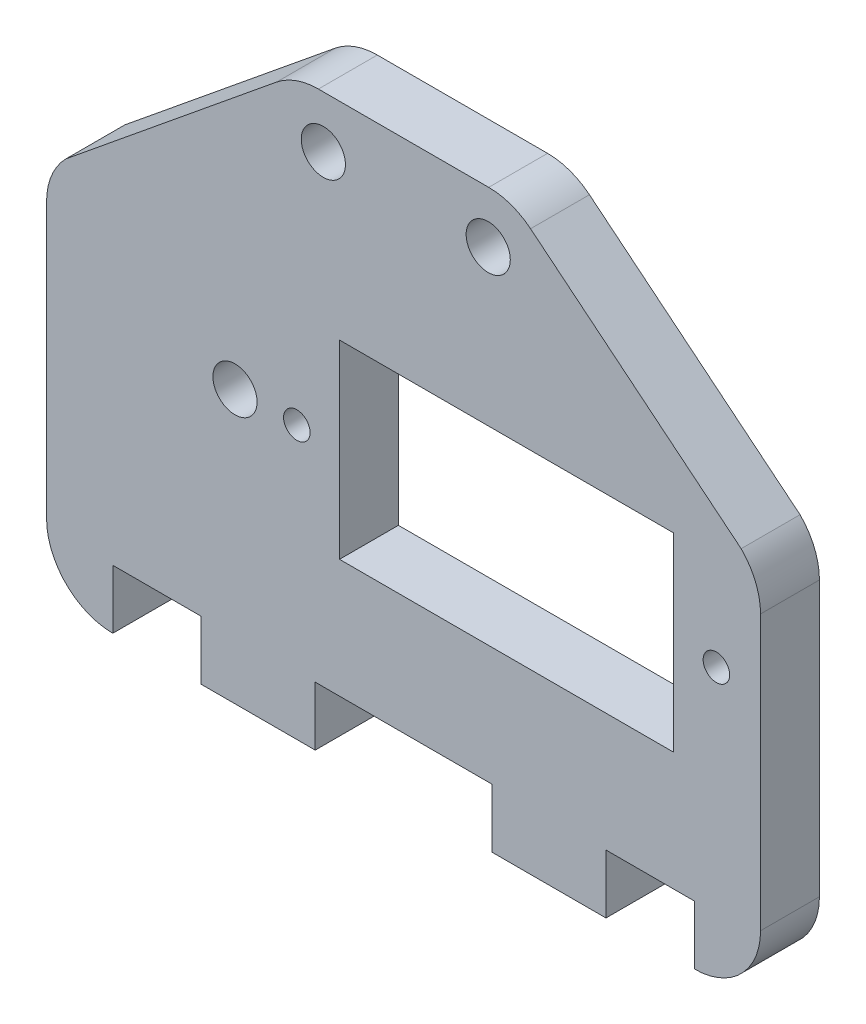
ISO-10303-21;
HEADER;
FILE_DESCRIPTION(('STEP AP214'),'2;1');
FILE_NAME('part.step','',(''),(''),'','','');
FILE_SCHEMA(('AUTOMOTIVE_DESIGN { 1 0 10303 214 1 1 1 1 }'));
ENDSEC;
DATA;
#1=APPLICATION_CONTEXT('core data for automotive mechanical design processes');
#2=APPLICATION_PROTOCOL_DEFINITION('international standard','automotive_design',2000,#1);
#3=PRODUCT_CONTEXT('',#1,'mechanical');
#4=PRODUCT('Part','Part','',(#3));
#5=PRODUCT_RELATED_PRODUCT_CATEGORY('part','',(#4));
#6=PRODUCT_DEFINITION_FORMATION('','',#4);
#7=PRODUCT_DEFINITION_CONTEXT('part definition',#1,'design');
#8=PRODUCT_DEFINITION('design','',#6,#7);
#9=PRODUCT_DEFINITION_SHAPE('','',#8);
#10=(LENGTH_UNIT() NAMED_UNIT(*) SI_UNIT(.MILLI.,.METRE.));
#11=(NAMED_UNIT(*) PLANE_ANGLE_UNIT() SI_UNIT($,.RADIAN.));
#12=(NAMED_UNIT(*) SI_UNIT($,.STERADIAN.) SOLID_ANGLE_UNIT());
#13=UNCERTAINTY_MEASURE_WITH_UNIT(LENGTH_MEASURE(1.E-05),#10,'distance_accuracy_value','');
#14=(GEOMETRIC_REPRESENTATION_CONTEXT(3) GLOBAL_UNCERTAINTY_ASSIGNED_CONTEXT((#13)) GLOBAL_UNIT_ASSIGNED_CONTEXT((#10,
#11,#12)) REPRESENTATION_CONTEXT('',''));
#15=CARTESIAN_POINT('',(0.,0.,0.));
#16=DIRECTION('',(0.,0.,1.));
#17=DIRECTION('',(1.,0.,0.));
#18=AXIS2_PLACEMENT_3D('',#15,#16,#17);
#19=CARTESIAN_POINT('',(44.0000008495149,4.66042127058839,4.));
#20=DIRECTION('',(0.,0.,1.));
#21=DIRECTION('',(1.,0.,0.));
#22=AXIS2_PLACEMENT_3D('',#19,#20,#21);
#23=PLANE('',#22);
#24=CARTESIAN_POINT('',(17.000000849515,18.6604212705884,4.));
#25=DIRECTION('',(0.,0.,1.));
#26=DIRECTION('',(1.,0.,0.));
#27=AXIS2_PLACEMENT_3D('',#24,#25,#26);
#28=CIRCLE('',#27,0.899999999999998);
#29=CARTESIAN_POINT('',(17.900000849515,18.6604212705884,4.));
#30=VERTEX_POINT('',#29);
#31=EDGE_CURVE('E234',#30,#30,#28,.T.);
#32=ORIENTED_EDGE('',*,*,#31,.F.);
#33=EDGE_LOOP('',(#32));
#34=FACE_BOUND('',#33,.T.);
#35=CARTESIAN_POINT('',(30.000000849515,35.6304212705884,4.));
#36=DIRECTION('',(0.,0.,1.));
#37=DIRECTION('',(1.,0.,0.));
#38=AXIS2_PLACEMENT_3D('',#35,#36,#37);
#39=CIRCLE('',#38,1.5);
#40=CARTESIAN_POINT('',(31.500000849515,35.6304212705884,4.));
#41=VERTEX_POINT('',#40);
#42=EDGE_CURVE('E244',#41,#41,#39,.T.);
#43=ORIENTED_EDGE('',*,*,#42,.F.);
#44=EDGE_LOOP('',(#43));
#45=FACE_BOUND('',#44,.T.);
#46=CARTESIAN_POINT('',(12.800000849515,18.6604212705884,4.));
#47=DIRECTION('',(0.,0.,1.));
#48=DIRECTION('',(1.,0.,0.));
#49=AXIS2_PLACEMENT_3D('',#46,#47,#48);
#50=CIRCLE('',#49,1.5);
#51=CARTESIAN_POINT('',(14.300000849515,18.6604212705884,4.));
#52=VERTEX_POINT('',#51);
#53=EDGE_CURVE('E256',#52,#52,#50,.T.);
#54=ORIENTED_EDGE('',*,*,#53,.F.);
#55=EDGE_LOOP('',(#54));
#56=FACE_BOUND('',#55,.T.);
#57=CARTESIAN_POINT('',(44.0000008495149,4.66042127058839,4.));
#58=DIRECTION('',(0.,0.,1.));
#59=DIRECTION('',(1.,0.,0.));
#60=AXIS2_PLACEMENT_3D('',#57,#58,#59);
#61=CIRCLE('',#60,4.5);
#62=CARTESIAN_POINT('',(44.0000008495149,0.160421270588386,4.));
#63=VERTEX_POINT('',#62);
#64=CARTESIAN_POINT('',(48.5000008495149,4.66042127058824,4.));
#65=VERTEX_POINT('',#64);
#66=EDGE_CURVE('E262',#63,#65,#61,.T.);
#67=ORIENTED_EDGE('',*,*,#66,.T.);
#68=DIRECTION('',(0.,1.,0.));
#69=VECTOR('',#68,1.);
#70=CARTESIAN_POINT('',(48.5000008495149,4.66042127058824,4.));
#71=LINE('',#70,#69);
#72=CARTESIAN_POINT('',(48.5000008495154,23.2964602399095,4.));
#73=VERTEX_POINT('',#72);
#74=EDGE_CURVE('E265',#65,#73,#71,.T.);
#75=ORIENTED_EDGE('',*,*,#74,.T.);
#76=CARTESIAN_POINT('',(44.0000008495154,23.2964602399096,4.));
#77=DIRECTION('',(0.,0.,1.));
#78=DIRECTION('',(1.,0.,0.));
#79=AXIS2_PLACEMENT_3D('',#76,#77,#78);
#80=CIRCLE('',#79,4.5);
#81=CARTESIAN_POINT('',(47.1819813648548,26.478440755249,4.));
#82=VERTEX_POINT('',#81);
#83=EDGE_CURVE('E268',#73,#82,#80,.T.);
#84=ORIENTED_EDGE('',*,*,#83,.T.);
#85=DIRECTION('',(-0.774870757012182,0.632119695886284,0.));
#86=VECTOR('',#85,1.);
#87=CARTESIAN_POINT('',(47.1819813648548,26.478440755249,4.));
#88=LINE('',#87,#86);
#89=CARTESIAN_POINT('',(32.8779047794396,38.1473396771433,4.));
#90=VERTEX_POINT('',#89);
#91=EDGE_CURVE('E270',#82,#90,#88,.T.);
#92=ORIENTED_EDGE('',*,*,#91,.T.);
#93=CARTESIAN_POINT('',(30.0333661479511,34.6604212705884,4.));
#94=DIRECTION('',(0.,0.,1.));
#95=DIRECTION('',(1.,0.,0.));
#96=AXIS2_PLACEMENT_3D('',#93,#94,#95);
#97=CIRCLE('',#96,4.50000000000003);
#98=CARTESIAN_POINT('',(30.0333661479511,39.1604212705885,4.));
#99=VERTEX_POINT('',#98);
#100=EDGE_CURVE('E272',#90,#99,#97,.T.);
#101=ORIENTED_EDGE('',*,*,#100,.T.);
#102=DIRECTION('',(-1.,0.,0.));
#103=VECTOR('',#102,1.);
#104=CARTESIAN_POINT('',(30.0333661479511,39.1604212705884,4.));
#105=LINE('',#104,#103);
#106=CARTESIAN_POINT('',(18.4666355510798,39.1604212705884,4.));
#107=VERTEX_POINT('',#106);
#108=EDGE_CURVE('E274',#99,#107,#105,.T.);
#109=ORIENTED_EDGE('',*,*,#108,.T.);
#110=CARTESIAN_POINT('',(18.4666355510798,34.6604212705884,4.));
#111=DIRECTION('',(0.,0.,1.));
#112=DIRECTION('',(1.,0.,0.));
#113=AXIS2_PLACEMENT_3D('',#110,#111,#112);
#114=CIRCLE('',#113,4.49999999999999);
#115=CARTESIAN_POINT('',(15.6220969195915,38.1473396771433,4.));
#116=VERTEX_POINT('',#115);
#117=EDGE_CURVE('E276',#107,#116,#114,.T.);
#118=ORIENTED_EDGE('',*,*,#117,.T.);
#119=DIRECTION('',(-0.77487075701219,-0.632119695886274,0.));
#120=VECTOR('',#119,1.);
#121=CARTESIAN_POINT('',(15.6220969195915,38.1473396771433,4.));
#122=LINE('',#121,#120);
#123=CARTESIAN_POINT('',(1.31802033417569,26.4784407552489,4.));
#124=VERTEX_POINT('',#123);
#125=EDGE_CURVE('E278',#116,#124,#122,.T.);
#126=ORIENTED_EDGE('',*,*,#125,.T.);
#127=CARTESIAN_POINT('',(4.50000084951512,23.2964602399094,4.));
#128=DIRECTION('',(0.,0.,1.));
#129=DIRECTION('',(1.,0.,0.));
#130=AXIS2_PLACEMENT_3D('',#127,#128,#129);
#131=CIRCLE('',#130,4.49999999999987);
#132=CARTESIAN_POINT('',(8.49515243740717E-07,23.2964602399094,4.));
#133=VERTEX_POINT('',#132);
#134=EDGE_CURVE('E280',#124,#133,#131,.T.);
#135=ORIENTED_EDGE('',*,*,#134,.T.);
#136=DIRECTION('',(0.,-1.,0.));
#137=VECTOR('',#136,1.);
#138=CARTESIAN_POINT('',(8.495153452E-07,23.2964602399094,4.));
#139=LINE('',#138,#137);
#140=CARTESIAN_POINT('',(8.495150041E-07,4.66042127058839,4.));
#141=VERTEX_POINT('',#140);
#142=EDGE_CURVE('E282',#133,#141,#139,.T.);
#143=ORIENTED_EDGE('',*,*,#142,.T.);
#144=CARTESIAN_POINT('',(4.50000084951512,4.66042127058839,4.));
#145=DIRECTION('',(0.,0.,1.));
#146=DIRECTION('',(1.,0.,0.));
#147=AXIS2_PLACEMENT_3D('',#144,#145,#146);
#148=CIRCLE('',#147,4.50000000000006);
#149=CARTESIAN_POINT('',(4.50000084951512,0.16042127058833,4.));
#150=VERTEX_POINT('',#149);
#151=EDGE_CURVE('E284',#141,#150,#148,.T.);
#152=ORIENTED_EDGE('',*,*,#151,.T.);
#153=DIRECTION('',(0.,1.,0.));
#154=VECTOR('',#153,1.);
#155=CARTESIAN_POINT('',(4.50000084951512,0.160421270588386,4.));
#156=LINE('',#155,#154);
#157=CARTESIAN_POINT('',(4.50000084951512,4.16042127058839,4.));
#158=VERTEX_POINT('',#157);
#159=EDGE_CURVE('E286',#150,#158,#156,.T.);
#160=ORIENTED_EDGE('',*,*,#159,.T.);
#161=DIRECTION('',(1.,0.,0.));
#162=VECTOR('',#161,1.);
#163=CARTESIAN_POINT('',(4.50000084951512,4.16042127058839,4.));
#164=LINE('',#163,#162);
#165=CARTESIAN_POINT('',(10.500000849515,4.16042127058839,4.));
#166=VERTEX_POINT('',#165);
#167=EDGE_CURVE('E288',#158,#166,#164,.T.);
#168=ORIENTED_EDGE('',*,*,#167,.T.);
#169=DIRECTION('',(0.,-1.,0.));
#170=VECTOR('',#169,1.);
#171=CARTESIAN_POINT('',(10.500000849515,4.16042127058839,4.));
#172=LINE('',#171,#170);
#173=CARTESIAN_POINT('',(10.500000849515,0.160421270588393,4.));
#174=VERTEX_POINT('',#173);
#175=EDGE_CURVE('E290',#166,#174,#172,.T.);
#176=ORIENTED_EDGE('',*,*,#175,.T.);
#177=DIRECTION('',(1.,0.,0.));
#178=VECTOR('',#177,1.);
#179=CARTESIAN_POINT('',(10.500000849515,0.160421270588393,4.));
#180=LINE('',#179,#178);
#181=CARTESIAN_POINT('',(18.250000849515,0.160421270588393,4.));
#182=VERTEX_POINT('',#181);
#183=EDGE_CURVE('E292',#174,#182,#180,.T.);
#184=ORIENTED_EDGE('',*,*,#183,.T.);
#185=DIRECTION('',(0.,1.,0.));
#186=VECTOR('',#185,1.);
#187=CARTESIAN_POINT('',(18.250000849515,4.16042127058839,4.));
#188=LINE('',#187,#186);
#189=CARTESIAN_POINT('',(18.250000849515,4.16042127058839,4.));
#190=VERTEX_POINT('',#189);
#191=EDGE_CURVE('E294',#182,#190,#188,.T.);
#192=ORIENTED_EDGE('',*,*,#191,.T.);
#193=DIRECTION('',(1.,0.,0.));
#194=VECTOR('',#193,1.);
#195=CARTESIAN_POINT('',(18.250000849515,4.16042127058839,4.));
#196=LINE('',#195,#194);
#197=CARTESIAN_POINT('',(30.250000849515,4.16042127058839,4.));
#198=VERTEX_POINT('',#197);
#199=EDGE_CURVE('E296',#190,#198,#196,.T.);
#200=ORIENTED_EDGE('',*,*,#199,.T.);
#201=DIRECTION('',(0.,-1.,0.));
#202=VECTOR('',#201,1.);
#203=CARTESIAN_POINT('',(30.250000849515,4.16042127058839,4.));
#204=LINE('',#203,#202);
#205=CARTESIAN_POINT('',(30.250000849515,0.160421270588393,4.));
#206=VERTEX_POINT('',#205);
#207=EDGE_CURVE('E298',#198,#206,#204,.T.);
#208=ORIENTED_EDGE('',*,*,#207,.T.);
#209=DIRECTION('',(1.,0.,0.));
#210=VECTOR('',#209,1.);
#211=CARTESIAN_POINT('',(30.250000849515,0.160421270588393,4.));
#212=LINE('',#211,#210);
#213=CARTESIAN_POINT('',(38.0000008495148,0.160421270588393,4.));
#214=VERTEX_POINT('',#213);
#215=EDGE_CURVE('E300',#206,#214,#212,.T.);
#216=ORIENTED_EDGE('',*,*,#215,.T.);
#217=DIRECTION('',(0.,1.,0.));
#218=VECTOR('',#217,1.);
#219=CARTESIAN_POINT('',(38.0000008495148,4.16042127058839,4.));
#220=LINE('',#219,#218);
#221=CARTESIAN_POINT('',(38.0000008495148,4.16042127058839,4.));
#222=VERTEX_POINT('',#221);
#223=EDGE_CURVE('E302',#214,#222,#220,.T.);
#224=ORIENTED_EDGE('',*,*,#223,.T.);
#225=DIRECTION('',(1.,0.,0.));
#226=VECTOR('',#225,1.);
#227=CARTESIAN_POINT('',(44.0000008495149,4.16042127058839,4.));
#228=LINE('',#227,#226);
#229=CARTESIAN_POINT('',(44.0000008495149,4.16042127058839,4.));
#230=VERTEX_POINT('',#229);
#231=EDGE_CURVE('E304',#222,#230,#228,.T.);
#232=ORIENTED_EDGE('',*,*,#231,.T.);
#233=DIRECTION('',(0.,-1.,0.));
#234=VECTOR('',#233,1.);
#235=CARTESIAN_POINT('',(44.0000008495149,0.160421270588386,4.));
#236=LINE('',#235,#234);
#237=EDGE_CURVE('E306',#230,#63,#236,.T.);
#238=ORIENTED_EDGE('',*,*,#237,.T.);
#239=EDGE_LOOP('',(#67,#75,#84,#92,#101,#109,#118,#126,#135,#143,#152,#160,#168,#176,#184,#192,
#200,#208,#216,#224,#232,#238));
#240=FACE_BOUND('',#239,.T.);
#241=CARTESIAN_POINT('',(18.800000849515,35.6304212705884,4.));
#242=DIRECTION('',(0.,0.,1.));
#243=DIRECTION('',(1.,0.,0.));
#244=AXIS2_PLACEMENT_3D('',#241,#242,#243);
#245=CIRCLE('',#244,1.5);
#246=CARTESIAN_POINT('',(20.300000849515,35.6304212705884,4.));
#247=VERTEX_POINT('',#246);
#248=EDGE_CURVE('E250',#247,#247,#245,.T.);
#249=ORIENTED_EDGE('',*,*,#248,.F.);
#250=EDGE_LOOP('',(#249));
#251=FACE_BOUND('',#250,.T.);
#252=DIRECTION('',(-1.,0.,0.));
#253=VECTOR('',#252,1.);
#254=CARTESIAN_POINT('',(42.600000849515,25.1104212705884,4.));
#255=LINE('',#254,#253);
#256=CARTESIAN_POINT('',(42.600000849515,25.1104212705884,4.));
#257=VERTEX_POINT('',#256);
#258=CARTESIAN_POINT('',(19.9000008495151,25.1104212705884,4.));
#259=VERTEX_POINT('',#258);
#260=EDGE_CURVE('E213',#257,#259,#255,.T.);
#261=ORIENTED_EDGE('',*,*,#260,.F.);
#262=DIRECTION('',(0.,1.,0.));
#263=VECTOR('',#262,1.);
#264=CARTESIAN_POINT('',(42.600000849515,25.1104212705884,4.));
#265=LINE('',#264,#263);
#266=CARTESIAN_POINT('',(42.600000849515,12.2104212705884,4.));
#267=VERTEX_POINT('',#266);
#268=EDGE_CURVE('E205',#267,#257,#265,.T.);
#269=ORIENTED_EDGE('',*,*,#268,.F.);
#270=DIRECTION('',(1.,0.,0.));
#271=VECTOR('',#270,1.);
#272=CARTESIAN_POINT('',(19.9000008495151,12.2104212705884,4.));
#273=LINE('',#272,#271);
#274=CARTESIAN_POINT('',(19.9000008495151,12.2104212705884,4.));
#275=VERTEX_POINT('',#274);
#276=EDGE_CURVE('E228',#275,#267,#273,.T.);
#277=ORIENTED_EDGE('',*,*,#276,.F.);
#278=DIRECTION('',(0.,-1.,0.));
#279=VECTOR('',#278,1.);
#280=CARTESIAN_POINT('',(19.9000008495151,25.1104212705884,4.));
#281=LINE('',#280,#279);
#282=EDGE_CURVE('E226',#259,#275,#281,.T.);
#283=ORIENTED_EDGE('',*,*,#282,.F.);
#284=EDGE_LOOP('',(#261,#269,#277,#283));
#285=FACE_BOUND('',#284,.T.);
#286=CARTESIAN_POINT('',(45.5000008495148,18.6604212705884,4.));
#287=DIRECTION('',(0.,0.,1.));
#288=DIRECTION('',(1.,0.,0.));
#289=AXIS2_PLACEMENT_3D('',#286,#287,#288);
#290=CIRCLE('',#289,0.899999999999998);
#291=CARTESIAN_POINT('',(46.4000008495148,18.6604212705884,4.));
#292=VERTEX_POINT('',#291);
#293=EDGE_CURVE('E805',#292,#292,#290,.T.);
#294=ORIENTED_EDGE('',*,*,#293,.F.);
#295=EDGE_LOOP('',(#294));
#296=FACE_BOUND('',#295,.T.);
#297=ADVANCED_FACE('F32',(#34,#45,#56,#240,#251,#285,#296),#23,.T.);
#298=CARTESIAN_POINT('',(44.0000008495149,4.66042127058839,0.));
#299=DIRECTION('',(0.,0.,1.));
#300=DIRECTION('',(1.,0.,0.));
#301=AXIS2_PLACEMENT_3D('',#298,#299,#300);
#302=PLANE('',#301);
#303=CARTESIAN_POINT('',(17.000000849515,18.6604212705884,0.));
#304=DIRECTION('',(0.,0.,1.));
#305=DIRECTION('',(1.,0.,0.));
#306=AXIS2_PLACEMENT_3D('',#303,#304,#305);
#307=CIRCLE('',#306,0.899999999999998);
#308=CARTESIAN_POINT('',(17.900000849515,18.6604212705884,0.));
#309=VERTEX_POINT('',#308);
#310=EDGE_CURVE('E811',#309,#309,#307,.T.);
#311=ORIENTED_EDGE('',*,*,#310,.T.);
#312=EDGE_LOOP('',(#311));
#313=FACE_BOUND('',#312,.T.);
#314=CARTESIAN_POINT('',(30.000000849515,35.6304212705884,0.));
#315=DIRECTION('',(0.,0.,1.));
#316=DIRECTION('',(1.,0.,0.));
#317=AXIS2_PLACEMENT_3D('',#314,#315,#316);
#318=CIRCLE('',#317,1.5);
#319=CARTESIAN_POINT('',(31.500000849515,35.6304212705884,0.));
#320=VERTEX_POINT('',#319);
#321=EDGE_CURVE('E221',#320,#320,#318,.T.);
#322=ORIENTED_EDGE('',*,*,#321,.T.);
#323=EDGE_LOOP('',(#322));
#324=FACE_BOUND('',#323,.T.);
#325=CARTESIAN_POINT('',(12.800000849515,18.6604212705884,0.));
#326=DIRECTION('',(0.,0.,1.));
#327=DIRECTION('',(1.,0.,0.));
#328=AXIS2_PLACEMENT_3D('',#325,#326,#327);
#329=CIRCLE('',#328,1.5);
#330=CARTESIAN_POINT('',(14.300000849515,18.6604212705884,0.));
#331=VERTEX_POINT('',#330);
#332=EDGE_CURVE('E253',#331,#331,#329,.T.);
#333=ORIENTED_EDGE('',*,*,#332,.T.);
#334=EDGE_LOOP('',(#333));
#335=FACE_BOUND('',#334,.T.);
#336=CARTESIAN_POINT('',(44.0000008495149,4.66042127058839,0.));
#337=DIRECTION('',(0.,0.,1.));
#338=DIRECTION('',(1.,0.,0.));
#339=AXIS2_PLACEMENT_3D('',#336,#337,#338);
#340=CIRCLE('',#339,4.5);
#341=CARTESIAN_POINT('',(44.0000008495149,0.160421270588386,0.));
#342=VERTEX_POINT('',#341);
#343=CARTESIAN_POINT('',(48.5000008495149,4.66042127058824,0.));
#344=VERTEX_POINT('',#343);
#345=EDGE_CURVE('E259',#342,#344,#340,.T.);
#346=ORIENTED_EDGE('',*,*,#345,.F.);
#347=DIRECTION('',(0.,-1.,0.));
#348=VECTOR('',#347,1.);
#349=CARTESIAN_POINT('',(44.0000008495149,0.160421270588386,0.));
#350=LINE('',#349,#348);
#351=CARTESIAN_POINT('',(44.0000008495149,4.16042127058839,0.));
#352=VERTEX_POINT('',#351);
#353=EDGE_CURVE('E266',#352,#342,#350,.T.);
#354=ORIENTED_EDGE('',*,*,#353,.F.);
#355=DIRECTION('',(1.,0.,0.));
#356=VECTOR('',#355,1.);
#357=CARTESIAN_POINT('',(44.0000008495149,4.16042127058839,0.));
#358=LINE('',#357,#356);
#359=CARTESIAN_POINT('',(38.0000008495148,4.16042127058839,0.));
#360=VERTEX_POINT('',#359);
#361=EDGE_CURVE('E349',#360,#352,#358,.T.);
#362=ORIENTED_EDGE('',*,*,#361,.F.);
#363=DIRECTION('',(0.,1.,0.));
#364=VECTOR('',#363,1.);
#365=CARTESIAN_POINT('',(38.0000008495148,4.16042127058839,0.));
#366=LINE('',#365,#364);
#367=CARTESIAN_POINT('',(38.0000008495148,0.160421270588393,0.));
#368=VERTEX_POINT('',#367);
#369=EDGE_CURVE('E347',#368,#360,#366,.T.);
#370=ORIENTED_EDGE('',*,*,#369,.F.);
#371=DIRECTION('',(1.,0.,0.));
#372=VECTOR('',#371,1.);
#373=CARTESIAN_POINT('',(30.250000849515,0.160421270588393,0.));
#374=LINE('',#373,#372);
#375=CARTESIAN_POINT('',(30.250000849515,0.160421270588393,0.));
#376=VERTEX_POINT('',#375);
#377=EDGE_CURVE('E345',#376,#368,#374,.T.);
#378=ORIENTED_EDGE('',*,*,#377,.F.);
#379=DIRECTION('',(0.,-1.,0.));
#380=VECTOR('',#379,1.);
#381=CARTESIAN_POINT('',(30.250000849515,4.16042127058839,0.));
#382=LINE('',#381,#380);
#383=CARTESIAN_POINT('',(30.250000849515,4.16042127058839,0.));
#384=VERTEX_POINT('',#383);
#385=EDGE_CURVE('E343',#384,#376,#382,.T.);
#386=ORIENTED_EDGE('',*,*,#385,.F.);
#387=DIRECTION('',(1.,0.,0.));
#388=VECTOR('',#387,1.);
#389=CARTESIAN_POINT('',(18.250000849515,4.16042127058839,0.));
#390=LINE('',#389,#388);
#391=CARTESIAN_POINT('',(18.250000849515,4.16042127058839,0.));
#392=VERTEX_POINT('',#391);
#393=EDGE_CURVE('E341',#392,#384,#390,.T.);
#394=ORIENTED_EDGE('',*,*,#393,.F.);
#395=DIRECTION('',(0.,1.,0.));
#396=VECTOR('',#395,1.);
#397=CARTESIAN_POINT('',(18.250000849515,4.16042127058839,0.));
#398=LINE('',#397,#396);
#399=CARTESIAN_POINT('',(18.250000849515,0.160421270588393,0.));
#400=VERTEX_POINT('',#399);
#401=EDGE_CURVE('E339',#400,#392,#398,.T.);
#402=ORIENTED_EDGE('',*,*,#401,.F.);
#403=DIRECTION('',(1.,0.,0.));
#404=VECTOR('',#403,1.);
#405=CARTESIAN_POINT('',(10.500000849515,0.160421270588393,0.));
#406=LINE('',#405,#404);
#407=CARTESIAN_POINT('',(10.500000849515,0.160421270588393,0.));
#408=VERTEX_POINT('',#407);
#409=EDGE_CURVE('E337',#408,#400,#406,.T.);
#410=ORIENTED_EDGE('',*,*,#409,.F.);
#411=DIRECTION('',(0.,-1.,0.));
#412=VECTOR('',#411,1.);
#413=CARTESIAN_POINT('',(10.500000849515,4.16042127058839,0.));
#414=LINE('',#413,#412);
#415=CARTESIAN_POINT('',(10.500000849515,4.16042127058839,0.));
#416=VERTEX_POINT('',#415);
#417=EDGE_CURVE('E335',#416,#408,#414,.T.);
#418=ORIENTED_EDGE('',*,*,#417,.F.);
#419=DIRECTION('',(1.,0.,0.));
#420=VECTOR('',#419,1.);
#421=CARTESIAN_POINT('',(4.50000084951512,4.16042127058839,0.));
#422=LINE('',#421,#420);
#423=CARTESIAN_POINT('',(4.50000084951512,4.16042127058839,0.));
#424=VERTEX_POINT('',#423);
#425=EDGE_CURVE('E333',#424,#416,#422,.T.);
#426=ORIENTED_EDGE('',*,*,#425,.F.);
#427=DIRECTION('',(0.,1.,0.));
#428=VECTOR('',#427,1.);
#429=CARTESIAN_POINT('',(4.50000084951512,0.160421270588386,0.));
#430=LINE('',#429,#428);
#431=CARTESIAN_POINT('',(4.50000084951512,0.16042127058833,0.));
#432=VERTEX_POINT('',#431);
#433=EDGE_CURVE('E331',#432,#424,#430,.T.);
#434=ORIENTED_EDGE('',*,*,#433,.F.);
#435=CARTESIAN_POINT('',(4.50000084951512,4.66042127058839,0.));
#436=DIRECTION('',(0.,0.,1.));
#437=DIRECTION('',(1.,0.,0.));
#438=AXIS2_PLACEMENT_3D('',#435,#436,#437);
#439=CIRCLE('',#438,4.50000000000006);
#440=CARTESIAN_POINT('',(8.495150041E-07,4.66042127058839,0.));
#441=VERTEX_POINT('',#440);
#442=EDGE_CURVE('E329',#441,#432,#439,.T.);
#443=ORIENTED_EDGE('',*,*,#442,.F.);
#444=DIRECTION('',(0.,-1.,0.));
#445=VECTOR('',#444,1.);
#446=CARTESIAN_POINT('',(8.495153452E-07,23.2964602399094,0.));
#447=LINE('',#446,#445);
#448=CARTESIAN_POINT('',(8.49515243740717E-07,23.2964602399094,0.));
#449=VERTEX_POINT('',#448);
#450=EDGE_CURVE('E327',#449,#441,#447,.T.);
#451=ORIENTED_EDGE('',*,*,#450,.F.);
#452=CARTESIAN_POINT('',(4.50000084951512,23.2964602399094,0.));
#453=DIRECTION('',(0.,0.,1.));
#454=DIRECTION('',(1.,0.,0.));
#455=AXIS2_PLACEMENT_3D('',#452,#453,#454);
#456=CIRCLE('',#455,4.49999999999987);
#457=CARTESIAN_POINT('',(1.31802033417569,26.4784407552489,0.));
#458=VERTEX_POINT('',#457);
#459=EDGE_CURVE('E325',#458,#449,#456,.T.);
#460=ORIENTED_EDGE('',*,*,#459,.F.);
#461=DIRECTION('',(-0.77487075701219,-0.632119695886274,0.));
#462=VECTOR('',#461,1.);
#463=CARTESIAN_POINT('',(15.6220969195915,38.1473396771433,0.));
#464=LINE('',#463,#462);
#465=CARTESIAN_POINT('',(15.6220969195915,38.1473396771433,0.));
#466=VERTEX_POINT('',#465);
#467=EDGE_CURVE('E323',#466,#458,#464,.T.);
#468=ORIENTED_EDGE('',*,*,#467,.F.);
#469=CARTESIAN_POINT('',(18.4666355510798,34.6604212705884,0.));
#470=DIRECTION('',(0.,0.,1.));
#471=DIRECTION('',(1.,0.,0.));
#472=AXIS2_PLACEMENT_3D('',#469,#470,#471);
#473=CIRCLE('',#472,4.49999999999999);
#474=CARTESIAN_POINT('',(18.4666355510798,39.1604212705884,0.));
#475=VERTEX_POINT('',#474);
#476=EDGE_CURVE('E321',#475,#466,#473,.T.);
#477=ORIENTED_EDGE('',*,*,#476,.F.);
#478=DIRECTION('',(-1.,0.,0.));
#479=VECTOR('',#478,1.);
#480=CARTESIAN_POINT('',(30.0333661479511,39.1604212705884,0.));
#481=LINE('',#480,#479);
#482=CARTESIAN_POINT('',(30.0333661479511,39.1604212705885,0.));
#483=VERTEX_POINT('',#482);
#484=EDGE_CURVE('E319',#483,#475,#481,.T.);
#485=ORIENTED_EDGE('',*,*,#484,.F.);
#486=CARTESIAN_POINT('',(30.0333661479511,34.6604212705884,0.));
#487=DIRECTION('',(0.,0.,1.));
#488=DIRECTION('',(1.,0.,0.));
#489=AXIS2_PLACEMENT_3D('',#486,#487,#488);
#490=CIRCLE('',#489,4.50000000000003);
#491=CARTESIAN_POINT('',(32.8779047794396,38.1473396771433,0.));
#492=VERTEX_POINT('',#491);
#493=EDGE_CURVE('E317',#492,#483,#490,.T.);
#494=ORIENTED_EDGE('',*,*,#493,.F.);
#495=DIRECTION('',(-0.774870757012182,0.632119695886284,0.));
#496=VECTOR('',#495,1.);
#497=CARTESIAN_POINT('',(47.1819813648548,26.478440755249,0.));
#498=LINE('',#497,#496);
#499=CARTESIAN_POINT('',(47.1819813648548,26.478440755249,0.));
#500=VERTEX_POINT('',#499);
#501=EDGE_CURVE('E315',#500,#492,#498,.T.);
#502=ORIENTED_EDGE('',*,*,#501,.F.);
#503=CARTESIAN_POINT('',(44.0000008495154,23.2964602399096,0.));
#504=DIRECTION('',(0.,0.,1.));
#505=DIRECTION('',(1.,0.,0.));
#506=AXIS2_PLACEMENT_3D('',#503,#504,#505);
#507=CIRCLE('',#506,4.5);
#508=CARTESIAN_POINT('',(48.5000008495154,23.2964602399095,0.));
#509=VERTEX_POINT('',#508);
#510=EDGE_CURVE('E313',#509,#500,#507,.T.);
#511=ORIENTED_EDGE('',*,*,#510,.F.);
#512=DIRECTION('',(0.,1.,0.));
#513=VECTOR('',#512,1.);
#514=CARTESIAN_POINT('',(48.5000008495149,4.66042127058824,0.));
#515=LINE('',#514,#513);
#516=EDGE_CURVE('E311',#344,#509,#515,.T.);
#517=ORIENTED_EDGE('',*,*,#516,.F.);
#518=EDGE_LOOP('',(#346,#354,#362,#370,#378,#386,#394,#402,#410,#418,#426,#434,#443,#451,#460,
#468,#477,#485,#494,#502,#511,#517));
#519=FACE_BOUND('',#518,.T.);
#520=CARTESIAN_POINT('',(18.800000849515,35.6304212705884,0.));
#521=DIRECTION('',(0.,0.,1.));
#522=DIRECTION('',(1.,0.,0.));
#523=AXIS2_PLACEMENT_3D('',#520,#521,#522);
#524=CIRCLE('',#523,1.5);
#525=CARTESIAN_POINT('',(20.300000849515,35.6304212705884,0.));
#526=VERTEX_POINT('',#525);
#527=EDGE_CURVE('E247',#526,#526,#524,.T.);
#528=ORIENTED_EDGE('',*,*,#527,.T.);
#529=EDGE_LOOP('',(#528));
#530=FACE_BOUND('',#529,.T.);
#531=DIRECTION('',(0.,1.,0.));
#532=VECTOR('',#531,1.);
#533=CARTESIAN_POINT('',(42.600000849515,25.1104212705884,0.));
#534=LINE('',#533,#532);
#535=CARTESIAN_POINT('',(42.600000849515,12.2104212705884,0.));
#536=VERTEX_POINT('',#535);
#537=CARTESIAN_POINT('',(42.600000849515,25.1104212705884,0.));
#538=VERTEX_POINT('',#537);
#539=EDGE_CURVE('E55',#536,#538,#534,.T.);
#540=ORIENTED_EDGE('',*,*,#539,.T.);
#541=DIRECTION('',(-1.,0.,0.));
#542=VECTOR('',#541,1.);
#543=CARTESIAN_POINT('',(42.600000849515,25.1104212705884,0.));
#544=LINE('',#543,#542);
#545=CARTESIAN_POINT('',(19.9000008495151,25.1104212705884,0.));
#546=VERTEX_POINT('',#545);
#547=EDGE_CURVE('E220',#538,#546,#544,.T.);
#548=ORIENTED_EDGE('',*,*,#547,.T.);
#549=DIRECTION('',(0.,-1.,0.));
#550=VECTOR('',#549,1.);
#551=CARTESIAN_POINT('',(19.9000008495151,25.1104212705884,0.));
#552=LINE('',#551,#550);
#553=CARTESIAN_POINT('',(19.9000008495151,12.2104212705884,0.));
#554=VERTEX_POINT('',#553);
#555=EDGE_CURVE('E236',#546,#554,#552,.T.);
#556=ORIENTED_EDGE('',*,*,#555,.T.);
#557=DIRECTION('',(1.,0.,0.));
#558=VECTOR('',#557,1.);
#559=CARTESIAN_POINT('',(19.9000008495151,12.2104212705884,0.));
#560=LINE('',#559,#558);
#561=EDGE_CURVE('E214',#554,#536,#560,.T.);
#562=ORIENTED_EDGE('',*,*,#561,.T.);
#563=EDGE_LOOP('',(#540,#548,#556,#562));
#564=FACE_BOUND('',#563,.T.);
#565=CARTESIAN_POINT('',(45.5000008495148,18.6604212705884,0.));
#566=DIRECTION('',(0.,0.,1.));
#567=DIRECTION('',(1.,0.,0.));
#568=AXIS2_PLACEMENT_3D('',#565,#566,#567);
#569=CIRCLE('',#568,0.899999999999998);
#570=CARTESIAN_POINT('',(46.4000008495148,18.6604212705884,0.));
#571=VERTEX_POINT('',#570);
#572=EDGE_CURVE('E808',#571,#571,#569,.T.);
#573=ORIENTED_EDGE('',*,*,#572,.T.);
#574=EDGE_LOOP('',(#573));
#575=FACE_BOUND('',#574,.T.);
#576=ADVANCED_FACE('F421',(#313,#324,#335,#519,#530,#564,#575),#302,.F.);
#577=CARTESIAN_POINT('',(44.0000008495149,4.66042127058839,4.));
#578=DIRECTION('',(0.,0.,-1.));
#579=DIRECTION('',(-1.,0.,0.));
#580=AXIS2_PLACEMENT_3D('',#577,#578,#579);
#581=CYLINDRICAL_SURFACE('',#580,4.5);
#582=ORIENTED_EDGE('',*,*,#345,.T.);
#583=DIRECTION('',(0.,0.,-1.));
#584=VECTOR('',#583,1.);
#585=CARTESIAN_POINT('',(48.5000008495149,4.66042127058824,4.));
#586=LINE('',#585,#584);
#587=EDGE_CURVE('E11',#65,#344,#586,.T.);
#588=ORIENTED_EDGE('',*,*,#587,.F.);
#589=ORIENTED_EDGE('',*,*,#66,.F.);
#590=DIRECTION('',(0.,0.,-1.));
#591=VECTOR('',#590,1.);
#592=CARTESIAN_POINT('',(44.0000008495149,0.160421270588386,4.));
#593=LINE('',#592,#591);
#594=EDGE_CURVE('E308',#63,#342,#593,.T.);
#595=ORIENTED_EDGE('',*,*,#594,.T.);
#596=EDGE_LOOP('',(#582,#588,#589,#595));
#597=FACE_BOUND('',#596,.T.);
#598=ADVANCED_FACE('F34',(#597),#581,.T.);
#599=CARTESIAN_POINT('',(48.5000008495149,4.66042127058824,4.));
#600=DIRECTION('',(-1.,0.,0.));
#601=DIRECTION('',(0.,-1.,0.));
#602=AXIS2_PLACEMENT_3D('',#599,#600,#601);
#603=PLANE('',#602);
#604=ORIENTED_EDGE('',*,*,#516,.T.);
#605=DIRECTION('',(0.,0.,-1.));
#606=VECTOR('',#605,1.);
#607=CARTESIAN_POINT('',(48.5000008495154,23.2964602399095,4.));
#608=LINE('',#607,#606);
#609=EDGE_CURVE('E40',#73,#509,#608,.T.);
#610=ORIENTED_EDGE('',*,*,#609,.F.);
#611=ORIENTED_EDGE('',*,*,#74,.F.);
#612=ORIENTED_EDGE('',*,*,#587,.T.);
#613=EDGE_LOOP('',(#604,#610,#611,#612));
#614=FACE_BOUND('',#613,.T.);
#615=ADVANCED_FACE('F439',(#614),#603,.F.);
#616=CARTESIAN_POINT('',(44.0000008495154,23.2964602399096,4.));
#617=DIRECTION('',(0.,0.,-1.));
#618=DIRECTION('',(-1.,0.,0.));
#619=AXIS2_PLACEMENT_3D('',#616,#617,#618);
#620=CYLINDRICAL_SURFACE('',#619,4.5);
#621=ORIENTED_EDGE('',*,*,#510,.T.);
#622=DIRECTION('',(0.,0.,-1.));
#623=VECTOR('',#622,1.);
#624=CARTESIAN_POINT('',(47.1819813648548,26.478440755249,4.));
#625=LINE('',#624,#623);
#626=EDGE_CURVE('E408',#82,#500,#625,.T.);
#627=ORIENTED_EDGE('',*,*,#626,.F.);
#628=ORIENTED_EDGE('',*,*,#83,.F.);
#629=ORIENTED_EDGE('',*,*,#609,.T.);
#630=EDGE_LOOP('',(#621,#627,#628,#629));
#631=FACE_BOUND('',#630,.T.);
#632=ADVANCED_FACE('F415',(#631),#620,.T.);
#633=CARTESIAN_POINT('',(47.1819813648548,26.478440755249,4.));
#634=DIRECTION('',(-0.632119695886284,-0.774870757012182,0.));
#635=DIRECTION('',(0.774870757012182,-0.632119695886284,0.));
#636=AXIS2_PLACEMENT_3D('',#633,#634,#635);
#637=PLANE('',#636);
#638=ORIENTED_EDGE('',*,*,#501,.T.);
#639=DIRECTION('',(0.,0.,-1.));
#640=VECTOR('',#639,1.);
#641=CARTESIAN_POINT('',(32.8779047794396,38.1473396771433,4.));
#642=LINE('',#641,#640);
#643=EDGE_CURVE('E405',#90,#492,#642,.T.);
#644=ORIENTED_EDGE('',*,*,#643,.F.);
#645=ORIENTED_EDGE('',*,*,#91,.F.);
#646=ORIENTED_EDGE('',*,*,#626,.T.);
#647=EDGE_LOOP('',(#638,#644,#645,#646));
#648=FACE_BOUND('',#647,.T.);
#649=ADVANCED_FACE('F427',(#648),#637,.F.);
#650=CARTESIAN_POINT('',(30.0333661479511,34.6604212705884,4.));
#651=DIRECTION('',(0.,0.,-1.));
#652=DIRECTION('',(-1.,0.,0.));
#653=AXIS2_PLACEMENT_3D('',#650,#651,#652);
#654=CYLINDRICAL_SURFACE('',#653,4.50000000000003);
#655=ORIENTED_EDGE('',*,*,#493,.T.);
#656=DIRECTION('',(0.,0.,-1.));
#657=VECTOR('',#656,1.);
#658=CARTESIAN_POINT('',(30.0333661479511,39.1604212705885,4.));
#659=LINE('',#658,#657);
#660=EDGE_CURVE('E402',#99,#483,#659,.T.);
#661=ORIENTED_EDGE('',*,*,#660,.F.);
#662=ORIENTED_EDGE('',*,*,#100,.F.);
#663=ORIENTED_EDGE('',*,*,#643,.T.);
#664=EDGE_LOOP('',(#655,#661,#662,#663));
#665=FACE_BOUND('',#664,.T.);
#666=ADVANCED_FACE('F431',(#665),#654,.T.);
#667=CARTESIAN_POINT('',(30.0333661479511,39.1604212705884,4.));
#668=DIRECTION('',(0.,-1.,0.));
#669=DIRECTION('',(0.,0.,-1.));
#670=AXIS2_PLACEMENT_3D('',#667,#668,#669);
#671=PLANE('',#670);
#672=ORIENTED_EDGE('',*,*,#484,.T.);
#673=DIRECTION('',(0.,0.,-1.));
#674=VECTOR('',#673,1.);
#675=CARTESIAN_POINT('',(18.4666355510798,39.1604212705884,4.));
#676=LINE('',#675,#674);
#677=EDGE_CURVE('E399',#107,#475,#676,.T.);
#678=ORIENTED_EDGE('',*,*,#677,.F.);
#679=ORIENTED_EDGE('',*,*,#108,.F.);
#680=ORIENTED_EDGE('',*,*,#660,.T.);
#681=EDGE_LOOP('',(#672,#678,#679,#680));
#682=FACE_BOUND('',#681,.T.);
#683=ADVANCED_FACE('F522',(#682),#671,.F.);
#684=CARTESIAN_POINT('',(18.4666355510798,34.6604212705884,4.));
#685=DIRECTION('',(0.,0.,-1.));
#686=DIRECTION('',(-1.,0.,0.));
#687=AXIS2_PLACEMENT_3D('',#684,#685,#686);
#688=CYLINDRICAL_SURFACE('',#687,4.49999999999999);
#689=ORIENTED_EDGE('',*,*,#476,.T.);
#690=DIRECTION('',(0.,0.,-1.));
#691=VECTOR('',#690,1.);
#692=CARTESIAN_POINT('',(15.6220969195915,38.1473396771433,4.));
#693=LINE('',#692,#691);
#694=EDGE_CURVE('E396',#116,#466,#693,.T.);
#695=ORIENTED_EDGE('',*,*,#694,.F.);
#696=ORIENTED_EDGE('',*,*,#117,.F.);
#697=ORIENTED_EDGE('',*,*,#677,.T.);
#698=EDGE_LOOP('',(#689,#695,#696,#697));
#699=FACE_BOUND('',#698,.T.);
#700=ADVANCED_FACE('F519',(#699),#688,.T.);
#701=CARTESIAN_POINT('',(15.6220969195915,38.1473396771433,4.));
#702=DIRECTION('',(0.632119695886274,-0.77487075701219,0.));
#703=DIRECTION('',(0.77487075701219,0.632119695886274,0.));
#704=AXIS2_PLACEMENT_3D('',#701,#702,#703);
#705=PLANE('',#704);
#706=ORIENTED_EDGE('',*,*,#467,.T.);
#707=DIRECTION('',(0.,0.,-1.));
#708=VECTOR('',#707,1.);
#709=CARTESIAN_POINT('',(1.31802033417569,26.4784407552489,4.));
#710=LINE('',#709,#708);
#711=EDGE_CURVE('E393',#124,#458,#710,.T.);
#712=ORIENTED_EDGE('',*,*,#711,.F.);
#713=ORIENTED_EDGE('',*,*,#125,.F.);
#714=ORIENTED_EDGE('',*,*,#694,.T.);
#715=EDGE_LOOP('',(#706,#712,#713,#714));
#716=FACE_BOUND('',#715,.T.);
#717=ADVANCED_FACE('F515',(#716),#705,.F.);
#718=CARTESIAN_POINT('',(4.50000084951512,23.2964602399094,4.));
#719=DIRECTION('',(0.,0.,-1.));
#720=DIRECTION('',(-1.,0.,0.));
#721=AXIS2_PLACEMENT_3D('',#718,#719,#720);
#722=CYLINDRICAL_SURFACE('',#721,4.49999999999987);
#723=ORIENTED_EDGE('',*,*,#459,.T.);
#724=DIRECTION('',(0.,0.,-1.));
#725=VECTOR('',#724,1.);
#726=CARTESIAN_POINT('',(8.49515243740717E-07,23.2964602399094,4.));
#727=LINE('',#726,#725);
#728=EDGE_CURVE('E390',#133,#449,#727,.T.);
#729=ORIENTED_EDGE('',*,*,#728,.F.);
#730=ORIENTED_EDGE('',*,*,#134,.F.);
#731=ORIENTED_EDGE('',*,*,#711,.T.);
#732=EDGE_LOOP('',(#723,#729,#730,#731));
#733=FACE_BOUND('',#732,.T.);
#734=ADVANCED_FACE('F511',(#733),#722,.T.);
#735=CARTESIAN_POINT('',(8.495153452E-07,23.2964602399094,4.));
#736=DIRECTION('',(1.,0.,0.));
#737=DIRECTION('',(0.,1.,0.));
#738=AXIS2_PLACEMENT_3D('',#735,#736,#737);
#739=PLANE('',#738);
#740=ORIENTED_EDGE('',*,*,#450,.T.);
#741=DIRECTION('',(0.,0.,-1.));
#742=VECTOR('',#741,1.);
#743=CARTESIAN_POINT('',(8.495150041E-07,4.66042127058839,4.));
#744=LINE('',#743,#742);
#745=EDGE_CURVE('E387',#141,#441,#744,.T.);
#746=ORIENTED_EDGE('',*,*,#745,.F.);
#747=ORIENTED_EDGE('',*,*,#142,.F.);
#748=ORIENTED_EDGE('',*,*,#728,.T.);
#749=EDGE_LOOP('',(#740,#746,#747,#748));
#750=FACE_BOUND('',#749,.T.);
#751=ADVANCED_FACE('F506',(#750),#739,.F.);
#752=CARTESIAN_POINT('',(4.50000084951512,4.66042127058839,4.));
#753=DIRECTION('',(0.,0.,-1.));
#754=DIRECTION('',(-1.,0.,0.));
#755=AXIS2_PLACEMENT_3D('',#752,#753,#754);
#756=CYLINDRICAL_SURFACE('',#755,4.50000000000006);
#757=ORIENTED_EDGE('',*,*,#442,.T.);
#758=DIRECTION('',(0.,0.,-1.));
#759=VECTOR('',#758,1.);
#760=CARTESIAN_POINT('',(4.50000084951512,0.16042127058833,4.));
#761=LINE('',#760,#759);
#762=EDGE_CURVE('E384',#150,#432,#761,.T.);
#763=ORIENTED_EDGE('',*,*,#762,.F.);
#764=ORIENTED_EDGE('',*,*,#151,.F.);
#765=ORIENTED_EDGE('',*,*,#745,.T.);
#766=EDGE_LOOP('',(#757,#763,#764,#765));
#767=FACE_BOUND('',#766,.T.);
#768=ADVANCED_FACE('F500',(#767),#756,.T.);
#769=CARTESIAN_POINT('',(4.50000084951512,0.160421270588386,4.));
#770=DIRECTION('',(-1.,0.,0.));
#771=DIRECTION('',(0.,-1.,0.));
#772=AXIS2_PLACEMENT_3D('',#769,#770,#771);
#773=PLANE('',#772);
#774=ORIENTED_EDGE('',*,*,#433,.T.);
#775=DIRECTION('',(0.,0.,-1.));
#776=VECTOR('',#775,1.);
#777=CARTESIAN_POINT('',(4.50000084951512,4.16042127058839,4.));
#778=LINE('',#777,#776);
#779=EDGE_CURVE('E381',#158,#424,#778,.T.);
#780=ORIENTED_EDGE('',*,*,#779,.F.);
#781=ORIENTED_EDGE('',*,*,#159,.F.);
#782=ORIENTED_EDGE('',*,*,#762,.T.);
#783=EDGE_LOOP('',(#774,#780,#781,#782));
#784=FACE_BOUND('',#783,.T.);
#785=ADVANCED_FACE('F496',(#784),#773,.F.);
#786=CARTESIAN_POINT('',(4.50000084951512,4.16042127058839,4.));
#787=DIRECTION('',(0.,1.,0.));
#788=DIRECTION('',(0.,0.,1.));
#789=AXIS2_PLACEMENT_3D('',#786,#787,#788);
#790=PLANE('',#789);
#791=ORIENTED_EDGE('',*,*,#425,.T.);
#792=DIRECTION('',(0.,0.,-1.));
#793=VECTOR('',#792,1.);
#794=CARTESIAN_POINT('',(10.500000849515,4.16042127058839,4.));
#795=LINE('',#794,#793);
#796=EDGE_CURVE('E378',#166,#416,#795,.T.);
#797=ORIENTED_EDGE('',*,*,#796,.F.);
#798=ORIENTED_EDGE('',*,*,#167,.F.);
#799=ORIENTED_EDGE('',*,*,#779,.T.);
#800=EDGE_LOOP('',(#791,#797,#798,#799));
#801=FACE_BOUND('',#800,.T.);
#802=ADVANCED_FACE('F491',(#801),#790,.F.);
#803=CARTESIAN_POINT('',(10.500000849515,4.16042127058839,4.));
#804=DIRECTION('',(1.,0.,0.));
#805=DIRECTION('',(0.,0.,-1.));
#806=AXIS2_PLACEMENT_3D('',#803,#804,#805);
#807=PLANE('',#806);
#808=ORIENTED_EDGE('',*,*,#417,.T.);
#809=DIRECTION('',(0.,0.,-1.));
#810=VECTOR('',#809,1.);
#811=CARTESIAN_POINT('',(10.500000849515,0.160421270588393,4.));
#812=LINE('',#811,#810);
#813=EDGE_CURVE('E375',#174,#408,#812,.T.);
#814=ORIENTED_EDGE('',*,*,#813,.F.);
#815=ORIENTED_EDGE('',*,*,#175,.F.);
#816=ORIENTED_EDGE('',*,*,#796,.T.);
#817=EDGE_LOOP('',(#808,#814,#815,#816));
#818=FACE_BOUND('',#817,.T.);
#819=ADVANCED_FACE('F485',(#818),#807,.F.);
#820=CARTESIAN_POINT('',(10.500000849515,0.160421270588393,4.));
#821=DIRECTION('',(0.,1.,0.));
#822=DIRECTION('',(0.,0.,1.));
#823=AXIS2_PLACEMENT_3D('',#820,#821,#822);
#824=PLANE('',#823);
#825=ORIENTED_EDGE('',*,*,#409,.T.);
#826=DIRECTION('',(0.,0.,-1.));
#827=VECTOR('',#826,1.);
#828=CARTESIAN_POINT('',(18.250000849515,0.160421270588393,4.));
#829=LINE('',#828,#827);
#830=EDGE_CURVE('E372',#182,#400,#829,.T.);
#831=ORIENTED_EDGE('',*,*,#830,.F.);
#832=ORIENTED_EDGE('',*,*,#183,.F.);
#833=ORIENTED_EDGE('',*,*,#813,.T.);
#834=EDGE_LOOP('',(#825,#831,#832,#833));
#835=FACE_BOUND('',#834,.T.);
#836=ADVANCED_FACE('F481',(#835),#824,.F.);
#837=CARTESIAN_POINT('',(18.250000849515,4.16042127058839,4.));
#838=DIRECTION('',(-1.,0.,0.));
#839=DIRECTION('',(0.,0.,1.));
#840=AXIS2_PLACEMENT_3D('',#837,#838,#839);
#841=PLANE('',#840);
#842=ORIENTED_EDGE('',*,*,#401,.T.);
#843=DIRECTION('',(0.,0.,-1.));
#844=VECTOR('',#843,1.);
#845=CARTESIAN_POINT('',(18.250000849515,4.16042127058839,4.));
#846=LINE('',#845,#844);
#847=EDGE_CURVE('E369',#190,#392,#846,.T.);
#848=ORIENTED_EDGE('',*,*,#847,.F.);
#849=ORIENTED_EDGE('',*,*,#191,.F.);
#850=ORIENTED_EDGE('',*,*,#830,.T.);
#851=EDGE_LOOP('',(#842,#848,#849,#850));
#852=FACE_BOUND('',#851,.T.);
#853=ADVANCED_FACE('F476',(#852),#841,.F.);
#854=CARTESIAN_POINT('',(18.250000849515,4.16042127058839,4.));
#855=DIRECTION('',(0.,1.,0.));
#856=DIRECTION('',(0.,0.,1.));
#857=AXIS2_PLACEMENT_3D('',#854,#855,#856);
#858=PLANE('',#857);
#859=ORIENTED_EDGE('',*,*,#393,.T.);
#860=DIRECTION('',(0.,0.,-1.));
#861=VECTOR('',#860,1.);
#862=CARTESIAN_POINT('',(30.250000849515,4.16042127058839,4.));
#863=LINE('',#862,#861);
#864=EDGE_CURVE('E366',#198,#384,#863,.T.);
#865=ORIENTED_EDGE('',*,*,#864,.F.);
#866=ORIENTED_EDGE('',*,*,#199,.F.);
#867=ORIENTED_EDGE('',*,*,#847,.T.);
#868=EDGE_LOOP('',(#859,#865,#866,#867));
#869=FACE_BOUND('',#868,.T.);
#870=ADVANCED_FACE('F470',(#869),#858,.F.);
#871=CARTESIAN_POINT('',(30.250000849515,4.16042127058839,4.));
#872=DIRECTION('',(1.,0.,0.));
#873=DIRECTION('',(0.,0.,-1.));
#874=AXIS2_PLACEMENT_3D('',#871,#872,#873);
#875=PLANE('',#874);
#876=ORIENTED_EDGE('',*,*,#385,.T.);
#877=DIRECTION('',(0.,0.,-1.));
#878=VECTOR('',#877,1.);
#879=CARTESIAN_POINT('',(30.250000849515,0.160421270588393,4.));
#880=LINE('',#879,#878);
#881=EDGE_CURVE('E363',#206,#376,#880,.T.);
#882=ORIENTED_EDGE('',*,*,#881,.F.);
#883=ORIENTED_EDGE('',*,*,#207,.F.);
#884=ORIENTED_EDGE('',*,*,#864,.T.);
#885=EDGE_LOOP('',(#876,#882,#883,#884));
#886=FACE_BOUND('',#885,.T.);
#887=ADVANCED_FACE('F466',(#886),#875,.F.);
#888=CARTESIAN_POINT('',(30.250000849515,0.160421270588393,4.));
#889=DIRECTION('',(0.,1.,0.));
#890=DIRECTION('',(0.,0.,1.));
#891=AXIS2_PLACEMENT_3D('',#888,#889,#890);
#892=PLANE('',#891);
#893=ORIENTED_EDGE('',*,*,#377,.T.);
#894=DIRECTION('',(0.,0.,-1.));
#895=VECTOR('',#894,1.);
#896=CARTESIAN_POINT('',(38.0000008495148,0.160421270588393,4.));
#897=LINE('',#896,#895);
#898=EDGE_CURVE('E360',#214,#368,#897,.T.);
#899=ORIENTED_EDGE('',*,*,#898,.F.);
#900=ORIENTED_EDGE('',*,*,#215,.F.);
#901=ORIENTED_EDGE('',*,*,#881,.T.);
#902=EDGE_LOOP('',(#893,#899,#900,#901));
#903=FACE_BOUND('',#902,.T.);
#904=ADVANCED_FACE('F461',(#903),#892,.F.);
#905=CARTESIAN_POINT('',(38.0000008495148,4.16042127058839,4.));
#906=DIRECTION('',(-1.,0.,0.));
#907=DIRECTION('',(0.,0.,1.));
#908=AXIS2_PLACEMENT_3D('',#905,#906,#907);
#909=PLANE('',#908);
#910=ORIENTED_EDGE('',*,*,#369,.T.);
#911=DIRECTION('',(0.,0.,-1.));
#912=VECTOR('',#911,1.);
#913=CARTESIAN_POINT('',(38.0000008495148,4.16042127058839,4.));
#914=LINE('',#913,#912);
#915=EDGE_CURVE('E357',#222,#360,#914,.T.);
#916=ORIENTED_EDGE('',*,*,#915,.F.);
#917=ORIENTED_EDGE('',*,*,#223,.F.);
#918=ORIENTED_EDGE('',*,*,#898,.T.);
#919=EDGE_LOOP('',(#910,#916,#917,#918));
#920=FACE_BOUND('',#919,.T.);
#921=ADVANCED_FACE('F455',(#920),#909,.F.);
#922=CARTESIAN_POINT('',(44.0000008495149,4.16042127058839,4.));
#923=DIRECTION('',(0.,1.,0.));
#924=DIRECTION('',(0.,0.,1.));
#925=AXIS2_PLACEMENT_3D('',#922,#923,#924);
#926=PLANE('',#925);
#927=ORIENTED_EDGE('',*,*,#361,.T.);
#928=DIRECTION('',(0.,0.,-1.));
#929=VECTOR('',#928,1.);
#930=CARTESIAN_POINT('',(44.0000008495149,4.16042127058839,4.));
#931=LINE('',#930,#929);
#932=EDGE_CURVE('E354',#230,#352,#931,.T.);
#933=ORIENTED_EDGE('',*,*,#932,.F.);
#934=ORIENTED_EDGE('',*,*,#231,.F.);
#935=ORIENTED_EDGE('',*,*,#915,.T.);
#936=EDGE_LOOP('',(#927,#933,#934,#935));
#937=FACE_BOUND('',#936,.T.);
#938=ADVANCED_FACE('F451',(#937),#926,.F.);
#939=CARTESIAN_POINT('',(44.0000008495149,0.160421270588386,4.));
#940=DIRECTION('',(1.,0.,0.));
#941=DIRECTION('',(0.,0.,-1.));
#942=AXIS2_PLACEMENT_3D('',#939,#940,#941);
#943=PLANE('',#942);
#944=ORIENTED_EDGE('',*,*,#353,.T.);
#945=ORIENTED_EDGE('',*,*,#594,.F.);
#946=ORIENTED_EDGE('',*,*,#237,.F.);
#947=ORIENTED_EDGE('',*,*,#932,.T.);
#948=EDGE_LOOP('',(#944,#945,#946,#947));
#949=FACE_BOUND('',#948,.T.);
#950=ADVANCED_FACE('F446',(#949),#943,.F.);
#951=CARTESIAN_POINT('',(12.800000849515,18.6604212705884,4.));
#952=DIRECTION('',(0.,0.,-1.));
#953=DIRECTION('',(-1.,0.,0.));
#954=AXIS2_PLACEMENT_3D('',#951,#952,#953);
#955=CYLINDRICAL_SURFACE('',#954,1.5);
#956=ORIENTED_EDGE('',*,*,#53,.T.);
#957=EDGE_LOOP('',(#956));
#958=FACE_BOUND('',#957,.T.);
#959=ORIENTED_EDGE('',*,*,#332,.F.);
#960=EDGE_LOOP('',(#959));
#961=FACE_BOUND('',#960,.T.);
#962=ADVANCED_FACE('F542',(#958,#961),#955,.F.);
#963=CARTESIAN_POINT('',(18.800000849515,35.6304212705884,4.));
#964=DIRECTION('',(0.,0.,-1.));
#965=DIRECTION('',(-1.,0.,0.));
#966=AXIS2_PLACEMENT_3D('',#963,#964,#965);
#967=CYLINDRICAL_SURFACE('',#966,1.5);
#968=ORIENTED_EDGE('',*,*,#248,.T.);
#969=EDGE_LOOP('',(#968));
#970=FACE_BOUND('',#969,.T.);
#971=ORIENTED_EDGE('',*,*,#527,.F.);
#972=EDGE_LOOP('',(#971));
#973=FACE_BOUND('',#972,.T.);
#974=ADVANCED_FACE('F640',(#970,#973),#967,.F.);
#975=CARTESIAN_POINT('',(30.000000849515,35.6304212705884,4.));
#976=DIRECTION('',(0.,0.,-1.));
#977=DIRECTION('',(-1.,0.,0.));
#978=AXIS2_PLACEMENT_3D('',#975,#976,#977);
#979=CYLINDRICAL_SURFACE('',#978,1.5);
#980=ORIENTED_EDGE('',*,*,#42,.T.);
#981=EDGE_LOOP('',(#980));
#982=FACE_BOUND('',#981,.T.);
#983=ORIENTED_EDGE('',*,*,#321,.F.);
#984=EDGE_LOOP('',(#983));
#985=FACE_BOUND('',#984,.T.);
#986=ADVANCED_FACE('F647',(#982,#985),#979,.F.);
#987=CARTESIAN_POINT('',(42.600000849515,25.1104212705884,4.));
#988=DIRECTION('',(-1.,0.,0.));
#989=DIRECTION('',(0.,0.,1.));
#990=AXIS2_PLACEMENT_3D('',#987,#988,#989);
#991=PLANE('',#990);
#992=ORIENTED_EDGE('',*,*,#539,.F.);
#993=DIRECTION('',(0.,0.,-1.));
#994=VECTOR('',#993,1.);
#995=CARTESIAN_POINT('',(42.600000849515,12.2104212705884,4.));
#996=LINE('',#995,#994);
#997=EDGE_CURVE('E209',#267,#536,#996,.T.);
#998=ORIENTED_EDGE('',*,*,#997,.F.);
#999=ORIENTED_EDGE('',*,*,#268,.T.);
#1000=DIRECTION('',(0.,0.,-1.));
#1001=VECTOR('',#1000,1.);
#1002=CARTESIAN_POINT('',(42.600000849515,25.1104212705884,4.));
#1003=LINE('',#1002,#1001);
#1004=EDGE_CURVE('E208',#257,#538,#1003,.T.);
#1005=ORIENTED_EDGE('',*,*,#1004,.T.);
#1006=EDGE_LOOP('',(#992,#998,#999,#1005));
#1007=FACE_BOUND('',#1006,.T.);
#1008=ADVANCED_FACE('F207',(#1007),#991,.T.);
#1009=CARTESIAN_POINT('',(42.600000849515,25.1104212705884,4.));
#1010=DIRECTION('',(0.,-1.,0.));
#1011=DIRECTION('',(0.,0.,-1.));
#1012=AXIS2_PLACEMENT_3D('',#1009,#1010,#1011);
#1013=PLANE('',#1012);
#1014=ORIENTED_EDGE('',*,*,#547,.F.);
#1015=ORIENTED_EDGE('',*,*,#1004,.F.);
#1016=ORIENTED_EDGE('',*,*,#260,.T.);
#1017=DIRECTION('',(0.,0.,-1.));
#1018=VECTOR('',#1017,1.);
#1019=CARTESIAN_POINT('',(19.9000008495151,25.1104212705884,4.));
#1020=LINE('',#1019,#1018);
#1021=EDGE_CURVE('E222',#259,#546,#1020,.T.);
#1022=ORIENTED_EDGE('',*,*,#1021,.T.);
#1023=EDGE_LOOP('',(#1014,#1015,#1016,#1022));
#1024=FACE_BOUND('',#1023,.T.);
#1025=ADVANCED_FACE('F217',(#1024),#1013,.T.);
#1026=CARTESIAN_POINT('',(19.9000008495151,25.1104212705884,4.));
#1027=DIRECTION('',(1.,0.,0.));
#1028=DIRECTION('',(0.,0.,-1.));
#1029=AXIS2_PLACEMENT_3D('',#1026,#1027,#1028);
#1030=PLANE('',#1029);
#1031=ORIENTED_EDGE('',*,*,#555,.F.);
#1032=ORIENTED_EDGE('',*,*,#1021,.F.);
#1033=ORIENTED_EDGE('',*,*,#282,.T.);
#1034=DIRECTION('',(0.,0.,-1.));
#1035=VECTOR('',#1034,1.);
#1036=CARTESIAN_POINT('',(19.9000008495151,12.2104212705884,4.));
#1037=LINE('',#1036,#1035);
#1038=EDGE_CURVE('E47',#275,#554,#1037,.T.);
#1039=ORIENTED_EDGE('',*,*,#1038,.T.);
#1040=EDGE_LOOP('',(#1031,#1032,#1033,#1039));
#1041=FACE_BOUND('',#1040,.T.);
#1042=ADVANCED_FACE('F667',(#1041),#1030,.T.);
#1043=CARTESIAN_POINT('',(19.9000008495151,12.2104212705884,4.));
#1044=DIRECTION('',(0.,1.,0.));
#1045=DIRECTION('',(0.,0.,1.));
#1046=AXIS2_PLACEMENT_3D('',#1043,#1044,#1045);
#1047=PLANE('',#1046);
#1048=ORIENTED_EDGE('',*,*,#561,.F.);
#1049=ORIENTED_EDGE('',*,*,#1038,.F.);
#1050=ORIENTED_EDGE('',*,*,#276,.T.);
#1051=ORIENTED_EDGE('',*,*,#997,.T.);
#1052=EDGE_LOOP('',(#1048,#1049,#1050,#1051));
#1053=FACE_BOUND('',#1052,.T.);
#1054=ADVANCED_FACE('F674',(#1053),#1047,.T.);
#1055=CARTESIAN_POINT('',(17.000000849515,18.6604212705884,4.));
#1056=DIRECTION('',(0.,0.,-1.));
#1057=DIRECTION('',(-1.,0.,0.));
#1058=AXIS2_PLACEMENT_3D('',#1055,#1056,#1057);
#1059=CYLINDRICAL_SURFACE('',#1058,0.899999999999998);
#1060=ORIENTED_EDGE('',*,*,#31,.T.);
#1061=EDGE_LOOP('',(#1060));
#1062=FACE_BOUND('',#1061,.T.);
#1063=ORIENTED_EDGE('',*,*,#310,.F.);
#1064=EDGE_LOOP('',(#1063));
#1065=FACE_BOUND('',#1064,.T.);
#1066=ADVANCED_FACE('F682',(#1062,#1065),#1059,.F.);
#1067=CARTESIAN_POINT('',(45.5000008495148,18.6604212705884,4.));
#1068=DIRECTION('',(0.,0.,-1.));
#1069=DIRECTION('',(-1.,0.,0.));
#1070=AXIS2_PLACEMENT_3D('',#1067,#1068,#1069);
#1071=CYLINDRICAL_SURFACE('',#1070,0.899999999999998);
#1072=ORIENTED_EDGE('',*,*,#293,.T.);
#1073=EDGE_LOOP('',(#1072));
#1074=FACE_BOUND('',#1073,.T.);
#1075=ORIENTED_EDGE('',*,*,#572,.F.);
#1076=EDGE_LOOP('',(#1075));
#1077=FACE_BOUND('',#1076,.T.);
#1078=ADVANCED_FACE('F689',(#1074,#1077),#1071,.F.);
#1079=CLOSED_SHELL('',(#297,#576,#598,#615,#632,#649,#666,#683,#700,#717,#734,#751,#768,#785,
#802,#819,#836,#853,#870,#887,#904,#921,#938,#950,#962,#974,#986,#1008,#1025,#1042,#1054,#1066,#1078));
#1080=MANIFOLD_SOLID_BREP('B2',#1079);
#1081=ADVANCED_BREP_SHAPE_REPRESENTATION('',(#18,#1080),#14);
#1082=SHAPE_DEFINITION_REPRESENTATION(#9,#1081);
ENDSEC;
END-ISO-10303-21;
